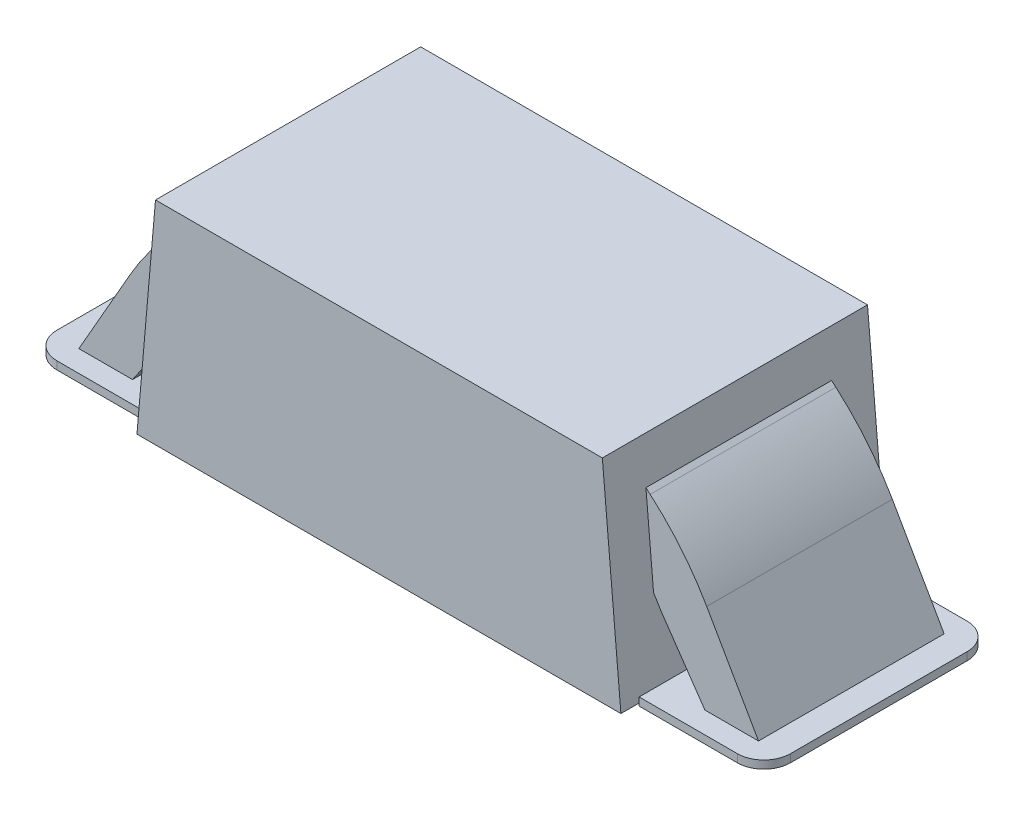
ISO-10303-21;
HEADER;
FILE_DESCRIPTION(('STEP AP214'),'2;1');
FILE_NAME('part.step','',(''),(''),'','','');
FILE_SCHEMA(('AUTOMOTIVE_DESIGN { 1 0 10303 214 1 1 1 1 }'));
ENDSEC;
DATA;
#1=APPLICATION_CONTEXT('core data for automotive mechanical design processes');
#2=APPLICATION_PROTOCOL_DEFINITION('international standard','automotive_design',2000,#1);
#3=PRODUCT_CONTEXT('',#1,'mechanical');
#4=PRODUCT('Part','Part','',(#3));
#5=PRODUCT_RELATED_PRODUCT_CATEGORY('part','',(#4));
#6=PRODUCT_DEFINITION_FORMATION('','',#4);
#7=PRODUCT_DEFINITION_CONTEXT('part definition',#1,'design');
#8=PRODUCT_DEFINITION('design','',#6,#7);
#9=PRODUCT_DEFINITION_SHAPE('','',#8);
#10=(LENGTH_UNIT() NAMED_UNIT(*) SI_UNIT(.MILLI.,.METRE.));
#11=(NAMED_UNIT(*) PLANE_ANGLE_UNIT() SI_UNIT($,.RADIAN.));
#12=(NAMED_UNIT(*) SI_UNIT($,.STERADIAN.) SOLID_ANGLE_UNIT());
#13=UNCERTAINTY_MEASURE_WITH_UNIT(LENGTH_MEASURE(1.E-05),#10,'distance_accuracy_value','');
#14=(GEOMETRIC_REPRESENTATION_CONTEXT(3) GLOBAL_UNCERTAINTY_ASSIGNED_CONTEXT((#13)) GLOBAL_UNIT_ASSIGNED_CONTEXT((#10,
#11,#12)) REPRESENTATION_CONTEXT('',''));
#15=CARTESIAN_POINT('',(0.,0.,0.));
#16=DIRECTION('',(0.,0.,1.));
#17=DIRECTION('',(1.,0.,0.));
#18=AXIS2_PLACEMENT_3D('',#15,#16,#17);
#19=CARTESIAN_POINT('',(0.912502267294813,0.02,0.431230723506814));
#20=DIRECTION('',(-1.,0.,0.));
#21=DIRECTION('',(0.,0.,-1.));
#22=AXIS2_PLACEMENT_3D('',#19,#20,#21);
#23=PLANE('',#22);
#24=DIRECTION('',(0.,-1.,0.));
#25=VECTOR('',#24,1.);
#26=CARTESIAN_POINT('',(0.912502267294813,0.02,0.431230723506814));
#27=LINE('',#26,#25);
#28=CARTESIAN_POINT('',(0.912502267294813,0.02,0.431230723506814));
#29=VERTEX_POINT('',#28);
#30=CARTESIAN_POINT('',(0.912502267294813,-0.01,0.431230723506814));
#31=VERTEX_POINT('',#30);
#32=EDGE_CURVE('P0_E190',#29,#31,#27,.T.);
#33=ORIENTED_EDGE('',*,*,#32,.F.);
#34=DIRECTION('',(0.,0.,1.));
#35=VECTOR('',#34,1.);
#36=CARTESIAN_POINT('',(0.912502267294813,0.02,0.431230723506814));
#37=LINE('',#36,#35);
#38=CARTESIAN_POINT('',(0.912502267294813,0.02,-0.434919537781297));
#39=VERTEX_POINT('',#38);
#40=EDGE_CURVE('P0_E179',#39,#29,#37,.T.);
#41=ORIENTED_EDGE('',*,*,#40,.F.);
#42=DIRECTION('',(0.,-1.,0.));
#43=VECTOR('',#42,1.);
#44=CARTESIAN_POINT('',(0.912502267294813,0.02,-0.434919537781297));
#45=LINE('',#44,#43);
#46=CARTESIAN_POINT('',(0.912502267294813,-0.01,-0.434919537781297));
#47=VERTEX_POINT('',#46);
#48=EDGE_CURVE('P0_E191',#39,#47,#45,.T.);
#49=ORIENTED_EDGE('',*,*,#48,.T.);
#50=DIRECTION('',(0.,0.,1.));
#51=VECTOR('',#50,1.);
#52=CARTESIAN_POINT('',(0.912502267294813,-0.01,0.431230723506814));
#53=LINE('',#52,#51);
#54=EDGE_CURVE('P0_E135',#47,#31,#53,.T.);
#55=ORIENTED_EDGE('',*,*,#54,.T.);
#56=EDGE_LOOP('',(#33,#41,#49,#55));
#57=FACE_BOUND('',#56,.T.);
#58=ADVANCED_FACE('P0_F17',(#57),#23,.T.);
#59=CARTESIAN_POINT('',(0.912502267294813,0.02,-0.434919537781297));
#60=DIRECTION('',(0.,0.,-1.));
#61=DIRECTION('',(1.,0.,0.));
#62=AXIS2_PLACEMENT_3D('',#59,#60,#61);
#63=PLANE('',#62);
#64=DIRECTION('',(-1.,0.,0.));
#65=VECTOR('',#64,1.);
#66=CARTESIAN_POINT('',(0.912502267294813,-0.01,-0.434919537781297));
#67=LINE('',#66,#65);
#68=CARTESIAN_POINT('',(1.28304789740573,-0.01,-0.434919537781297));
#69=VERTEX_POINT('',#68);
#70=EDGE_CURVE('P0_E177',#69,#47,#67,.T.);
#71=ORIENTED_EDGE('',*,*,#70,.T.);
#72=ORIENTED_EDGE('',*,*,#48,.F.);
#73=DIRECTION('',(-1.,0.,0.));
#74=VECTOR('',#73,1.);
#75=CARTESIAN_POINT('',(0.912502267294813,0.02,-0.434919537781297));
#76=LINE('',#75,#74);
#77=CARTESIAN_POINT('',(1.28304789740573,0.02,-0.434919537781297));
#78=VERTEX_POINT('',#77);
#79=EDGE_CURVE('P0_E188',#78,#39,#76,.T.);
#80=ORIENTED_EDGE('',*,*,#79,.F.);
#81=DIRECTION('',(0.,-1.,0.));
#82=VECTOR('',#81,1.);
#83=CARTESIAN_POINT('',(1.28304789740573,0.02,-0.434919537781297));
#84=LINE('',#83,#82);
#85=EDGE_CURVE('P0_E205',#69,#78,#84,.F.);
#86=ORIENTED_EDGE('',*,*,#85,.F.);
#87=EDGE_LOOP('',(#71,#72,#80,#86));
#88=FACE_BOUND('',#87,.T.);
#89=ADVANCED_FACE('P0_F242',(#88),#63,.T.);
#90=CARTESIAN_POINT('',(1.38304789740573,0.02,0.431230723506814));
#91=DIRECTION('',(1.,0.,0.));
#92=DIRECTION('',(0.,0.,1.));
#93=AXIS2_PLACEMENT_3D('',#90,#91,#92);
#94=PLANE('',#93);
#95=DIRECTION('',(0.,0.,-1.));
#96=VECTOR('',#95,1.);
#97=CARTESIAN_POINT('',(1.38304789740573,0.02,0.431230723506814));
#98=LINE('',#97,#96);
#99=CARTESIAN_POINT('',(1.38304789740573,0.02,0.331230723506814));
#100=VERTEX_POINT('',#99);
#101=CARTESIAN_POINT('',(1.38304789740573,0.02,-0.334919537781298));
#102=VERTEX_POINT('',#101);
#103=EDGE_CURVE('P0_E185',#100,#102,#98,.T.);
#104=ORIENTED_EDGE('',*,*,#103,.F.);
#105=DIRECTION('',(0.,-1.,0.));
#106=VECTOR('',#105,1.);
#107=CARTESIAN_POINT('',(1.38304789740573,0.02,0.331230723506814));
#108=LINE('',#107,#106);
#109=CARTESIAN_POINT('',(1.38304789740573,-0.01,0.331230723506814));
#110=VERTEX_POINT('',#109);
#111=EDGE_CURVE('P0_E194',#110,#100,#108,.F.);
#112=ORIENTED_EDGE('',*,*,#111,.F.);
#113=DIRECTION('',(0.,0.,-1.));
#114=VECTOR('',#113,1.);
#115=CARTESIAN_POINT('',(1.38304789740573,-0.01,0.431230723506814));
#116=LINE('',#115,#114);
#117=CARTESIAN_POINT('',(1.38304789740573,-0.01,-0.334919537781298));
#118=VERTEX_POINT('',#117);
#119=EDGE_CURVE('P0_E174',#110,#118,#116,.T.);
#120=ORIENTED_EDGE('',*,*,#119,.T.);
#121=DIRECTION('',(0.,-1.,0.));
#122=VECTOR('',#121,1.);
#123=CARTESIAN_POINT('',(1.38304789740573,0.02,-0.334919537781298));
#124=LINE('',#123,#122);
#125=EDGE_CURVE('P0_E198',#102,#118,#124,.T.);
#126=ORIENTED_EDGE('',*,*,#125,.F.);
#127=EDGE_LOOP('',(#104,#112,#120,#126));
#128=FACE_BOUND('',#127,.T.);
#129=ADVANCED_FACE('P0_F248',(#128),#94,.T.);
#130=CARTESIAN_POINT('',(0.912502267294813,0.02,0.431230723506814));
#131=DIRECTION('',(0.,0.,1.));
#132=DIRECTION('',(-1.,0.,0.));
#133=AXIS2_PLACEMENT_3D('',#130,#131,#132);
#134=PLANE('',#133);
#135=DIRECTION('',(1.,0.,0.));
#136=VECTOR('',#135,1.);
#137=CARTESIAN_POINT('',(0.912502267294813,0.02,0.431230723506814));
#138=LINE('',#137,#136);
#139=CARTESIAN_POINT('',(1.28304789740573,0.02,0.431230723506814));
#140=VERTEX_POINT('',#139);
#141=EDGE_CURVE('P0_E182',#29,#140,#138,.T.);
#142=ORIENTED_EDGE('',*,*,#141,.F.);
#143=ORIENTED_EDGE('',*,*,#32,.T.);
#144=DIRECTION('',(1.,0.,0.));
#145=VECTOR('',#144,1.);
#146=CARTESIAN_POINT('',(0.912502267294813,-0.01,0.431230723506814));
#147=LINE('',#146,#145);
#148=CARTESIAN_POINT('',(1.28304789740573,-0.01,0.431230723506814));
#149=VERTEX_POINT('',#148);
#150=EDGE_CURVE('P0_E171',#31,#149,#147,.T.);
#151=ORIENTED_EDGE('',*,*,#150,.T.);
#152=DIRECTION('',(0.,-1.,0.));
#153=VECTOR('',#152,1.);
#154=CARTESIAN_POINT('',(1.28304789740573,0.02,0.431230723506814));
#155=LINE('',#154,#153);
#156=EDGE_CURVE('P0_E211',#140,#149,#155,.T.);
#157=ORIENTED_EDGE('',*,*,#156,.F.);
#158=EDGE_LOOP('',(#142,#143,#151,#157));
#159=FACE_BOUND('',#158,.T.);
#160=ADVANCED_FACE('P0_F253',(#159),#134,.T.);
#161=CARTESIAN_POINT('',(0.,0.02,0.));
#162=DIRECTION('',(0.,1.,0.));
#163=DIRECTION('',(0.,0.,1.));
#164=AXIS2_PLACEMENT_3D('',#161,#162,#163);
#165=PLANE('',#164);
#166=DIRECTION('',(-1.,0.,0.));
#167=VECTOR('',#166,1.);
#168=CARTESIAN_POINT('',(0.,0.02,0.35));
#169=LINE('',#168,#167);
#170=CARTESIAN_POINT('',(1.28144697539297,0.02,0.35));
#171=VERTEX_POINT('',#170);
#172=CARTESIAN_POINT('',(1.07913504314039,0.02,0.35));
#173=VERTEX_POINT('',#172);
#174=EDGE_CURVE('P0_E11',#171,#173,#169,.T.);
#175=ORIENTED_EDGE('',*,*,#174,.T.);
#176=DIRECTION('',(0.,0.,1.));
#177=VECTOR('',#176,1.);
#178=CARTESIAN_POINT('',(1.07913504314039,0.02,0.));
#179=LINE('',#178,#177);
#180=CARTESIAN_POINT('',(1.07913504314039,0.02,-0.35));
#181=VERTEX_POINT('',#180);
#182=EDGE_CURVE('P0_E215',#181,#173,#179,.T.);
#183=ORIENTED_EDGE('',*,*,#182,.F.);
#184=DIRECTION('',(-1.,0.,0.));
#185=VECTOR('',#184,1.);
#186=CARTESIAN_POINT('',(0.,0.02,-0.35));
#187=LINE('',#186,#185);
#188=CARTESIAN_POINT('',(1.28144697539297,0.02,-0.35));
#189=VERTEX_POINT('',#188);
#190=EDGE_CURVE('P0_E213',#189,#181,#187,.T.);
#191=ORIENTED_EDGE('',*,*,#190,.F.);
#192=DIRECTION('',(0.,0.,-1.));
#193=VECTOR('',#192,1.);
#194=CARTESIAN_POINT('',(1.28144697539297,0.02,0.));
#195=LINE('',#194,#193);
#196=EDGE_CURVE('P0_E25',#171,#189,#195,.T.);
#197=ORIENTED_EDGE('',*,*,#196,.F.);
#198=EDGE_LOOP('',(#175,#183,#191,#197));
#199=FACE_BOUND('',#198,.T.);
#200=ORIENTED_EDGE('',*,*,#79,.T.);
#201=ORIENTED_EDGE('',*,*,#40,.T.);
#202=ORIENTED_EDGE('',*,*,#141,.T.);
#203=CARTESIAN_POINT('',(1.28304789740573,0.02,0.331230723506814));
#204=DIRECTION('',(0.,-1.,0.));
#205=DIRECTION('',(0.,0.,1.));
#206=AXIS2_PLACEMENT_3D('',#203,#204,#205);
#207=CIRCLE('',#206,0.1);
#208=EDGE_CURVE('P0_E40',#100,#140,#207,.T.);
#209=ORIENTED_EDGE('',*,*,#208,.F.);
#210=ORIENTED_EDGE('',*,*,#103,.T.);
#211=CARTESIAN_POINT('',(1.28304789740573,0.02,-0.334919537781298));
#212=DIRECTION('',(0.,-1.,0.));
#213=DIRECTION('',(0.,0.,1.));
#214=AXIS2_PLACEMENT_3D('',#211,#212,#213);
#215=CIRCLE('',#214,0.1);
#216=EDGE_CURVE('P0_E209',#78,#102,#215,.T.);
#217=ORIENTED_EDGE('',*,*,#216,.F.);
#218=EDGE_LOOP('',(#200,#201,#202,#209,#210,#217));
#219=FACE_BOUND('',#218,.T.);
#220=ADVANCED_FACE('P0_F225',(#199,#219),#165,.T.);
#221=CARTESIAN_POINT('',(0.,-0.01,0.));
#222=DIRECTION('',(0.,1.,0.));
#223=DIRECTION('',(0.,0.,1.));
#224=AXIS2_PLACEMENT_3D('',#221,#222,#223);
#225=PLANE('',#224);
#226=ORIENTED_EDGE('',*,*,#119,.F.);
#227=CARTESIAN_POINT('',(1.28304789740573,-0.01,0.331230723506814));
#228=DIRECTION('',(0.,-1.,0.));
#229=DIRECTION('',(0.,0.,1.));
#230=AXIS2_PLACEMENT_3D('',#227,#228,#229);
#231=CIRCLE('',#230,0.1);
#232=EDGE_CURVE('P0_E201',#149,#110,#231,.F.);
#233=ORIENTED_EDGE('',*,*,#232,.F.);
#234=ORIENTED_EDGE('',*,*,#150,.F.);
#235=ORIENTED_EDGE('',*,*,#54,.F.);
#236=ORIENTED_EDGE('',*,*,#70,.F.);
#237=CARTESIAN_POINT('',(1.28304789740573,-0.01,-0.334919537781298));
#238=DIRECTION('',(0.,-1.,0.));
#239=DIRECTION('',(0.,0.,1.));
#240=AXIS2_PLACEMENT_3D('',#237,#238,#239);
#241=CIRCLE('',#240,0.1);
#242=EDGE_CURVE('P0_E203',#118,#69,#241,.F.);
#243=ORIENTED_EDGE('',*,*,#242,.F.);
#244=EDGE_LOOP('',(#226,#233,#234,#235,#236,#243));
#245=FACE_BOUND('',#244,.T.);
#246=ADVANCED_FACE('P0_F257',(#245),#225,.F.);
#247=CARTESIAN_POINT('',(1.28304789740573,0.02,-0.334919537781298));
#248=DIRECTION('',(0.,-1.,0.));
#249=DIRECTION('',(0.,0.,-1.));
#250=AXIS2_PLACEMENT_3D('',#247,#248,#249);
#251=CYLINDRICAL_SURFACE('',#250,0.1);
#252=ORIENTED_EDGE('',*,*,#216,.T.);
#253=ORIENTED_EDGE('',*,*,#125,.T.);
#254=ORIENTED_EDGE('',*,*,#242,.T.);
#255=ORIENTED_EDGE('',*,*,#85,.T.);
#256=EDGE_LOOP('',(#252,#253,#254,#255));
#257=FACE_BOUND('',#256,.T.);
#258=ADVANCED_FACE('P0_F255',(#257),#251,.T.);
#259=CARTESIAN_POINT('',(1.28304789740573,0.02,0.331230723506814));
#260=DIRECTION('',(0.,-1.,0.));
#261=DIRECTION('',(0.,0.,-1.));
#262=AXIS2_PLACEMENT_3D('',#259,#260,#261);
#263=CYLINDRICAL_SURFACE('',#262,0.1);
#264=ORIENTED_EDGE('',*,*,#208,.T.);
#265=ORIENTED_EDGE('',*,*,#156,.T.);
#266=ORIENTED_EDGE('',*,*,#232,.T.);
#267=ORIENTED_EDGE('',*,*,#111,.T.);
#268=EDGE_LOOP('',(#264,#265,#266,#267));
#269=FACE_BOUND('',#268,.T.);
#270=ADVANCED_FACE('P0_F19',(#269),#263,.T.);
#271=CARTESIAN_POINT('',(0.856937476192038,0.635108468496678,0.35));
#272=DIRECTION('',(0.996194698091745,0.0871557427476654,0.));
#273=DIRECTION('',(0.0871557427476654,-0.996194698091745,0.));
#274=AXIS2_PLACEMENT_3D('',#271,#272,#273);
#275=PLANE('',#274);
#276=DIRECTION('',(-0.0871557427476654,0.996194698091745,0.));
#277=VECTOR('',#276,1.);
#278=CARTESIAN_POINT('',(0.856937476192038,0.635108468496678,-0.35));
#279=LINE('',#278,#277);
#280=CARTESIAN_POINT('',(0.885722482558173,0.306094340196465,-0.35));
#281=VERTEX_POINT('',#280);
#282=CARTESIAN_POINT('',(0.856937476192038,0.635108468496678,-0.35));
#283=VERTEX_POINT('',#282);
#284=EDGE_CURVE('P0_E153',#281,#283,#279,.T.);
#285=ORIENTED_EDGE('',*,*,#284,.F.);
#286=DIRECTION('',(0.,0.,-1.));
#287=VECTOR('',#286,1.);
#288=CARTESIAN_POINT('',(0.885722482558173,0.306094340196465,0.35));
#289=LINE('',#288,#287);
#290=CARTESIAN_POINT('',(0.885722482558173,0.306094340196465,0.35));
#291=VERTEX_POINT('',#290);
#292=EDGE_CURVE('P0_E140',#291,#281,#289,.T.);
#293=ORIENTED_EDGE('',*,*,#292,.F.);
#294=DIRECTION('',(-0.0871557427476654,0.996194698091745,0.));
#295=VECTOR('',#294,1.);
#296=CARTESIAN_POINT('',(0.856937476192038,0.635108468496678,0.35));
#297=LINE('',#296,#295);
#298=CARTESIAN_POINT('',(0.856937476192038,0.635108468496678,0.35));
#299=VERTEX_POINT('',#298);
#300=EDGE_CURVE('P0_E119',#291,#299,#297,.T.);
#301=ORIENTED_EDGE('',*,*,#300,.T.);
#302=DIRECTION('',(0.,0.,-1.));
#303=VECTOR('',#302,1.);
#304=CARTESIAN_POINT('',(0.856937476192038,0.635108468496678,0.35));
#305=LINE('',#304,#303);
#306=EDGE_CURVE('P0_E128',#299,#283,#305,.T.);
#307=ORIENTED_EDGE('',*,*,#306,.T.);
#308=EDGE_LOOP('',(#285,#293,#301,#307));
#309=FACE_BOUND('',#308,.T.);
#310=ADVANCED_FACE('P0_F138',(#309),#275,.F.);
#311=CARTESIAN_POINT('',(0.856937476192038,0.635108468496678,0.35));
#312=DIRECTION('',(-0.6551429084521,-0.755504976492494,0.));
#313=DIRECTION('',(-0.755504976492494,0.6551429084521,0.));
#314=AXIS2_PLACEMENT_3D('',#311,#312,#313);
#315=PLANE('',#314);
#316=DIRECTION('',(0.755504976492494,-0.655142908452099,0.));
#317=VECTOR('',#316,1.);
#318=CARTESIAN_POINT('',(0.856937476192038,0.635108468496678,-0.35));
#319=LINE('',#318,#317);
#320=CARTESIAN_POINT('',(0.873023804777973,0.621159064556239,-0.35));
#321=VERTEX_POINT('',#320);
#322=EDGE_CURVE('P0_E131',#283,#321,#319,.T.);
#323=ORIENTED_EDGE('',*,*,#322,.F.);
#324=ORIENTED_EDGE('',*,*,#306,.F.);
#325=DIRECTION('',(0.755504976492494,-0.655142908452099,0.));
#326=VECTOR('',#325,1.);
#327=CARTESIAN_POINT('',(0.856937476192038,0.635108468496678,0.35));
#328=LINE('',#327,#326);
#329=CARTESIAN_POINT('',(0.873023804777973,0.621159064556239,0.35));
#330=VERTEX_POINT('',#329);
#331=EDGE_CURVE('P0_E115',#299,#330,#328,.T.);
#332=ORIENTED_EDGE('',*,*,#331,.T.);
#333=DIRECTION('',(0.,0.,-1.));
#334=VECTOR('',#333,1.);
#335=CARTESIAN_POINT('',(0.873023804777973,0.621159064556239,0.35));
#336=LINE('',#335,#334);
#337=EDGE_CURVE('P0_E136',#330,#321,#336,.T.);
#338=ORIENTED_EDGE('',*,*,#337,.T.);
#339=EDGE_LOOP('',(#323,#324,#332,#338));
#340=FACE_BOUND('',#339,.T.);
#341=ADVANCED_FACE('P0_F129',(#340),#315,.F.);
#342=CARTESIAN_POINT('',(0.217880896325886,-0.134345911936265,0.35));
#343=DIRECTION('',(0.,0.,-1.));
#344=DIRECTION('',(1.,0.,0.));
#345=AXIS2_PLACEMENT_3D('',#342,#343,#344);
#346=CYLINDRICAL_SURFACE('',#345,1.);
#347=CARTESIAN_POINT('',(0.217880896325886,-0.134345911936265,-0.35));
#348=DIRECTION('',(0.,0.,-1.));
#349=DIRECTION('',(-1.,0.,0.));
#350=AXIS2_PLACEMENT_3D('',#347,#348,#349);
#351=CIRCLE('',#350,1.);
#352=CARTESIAN_POINT('',(1.08611021153654,0.361817222737039,-0.35));
#353=VERTEX_POINT('',#352);
#354=EDGE_CURVE('P0_E156',#321,#353,#351,.T.);
#355=ORIENTED_EDGE('',*,*,#354,.F.);
#356=ORIENTED_EDGE('',*,*,#337,.F.);
#357=CARTESIAN_POINT('',(0.217880896325886,-0.134345911936265,0.35));
#358=DIRECTION('',(0.,0.,-1.));
#359=DIRECTION('',(-1.,0.,0.));
#360=AXIS2_PLACEMENT_3D('',#357,#358,#359);
#361=CIRCLE('',#360,1.);
#362=CARTESIAN_POINT('',(1.08611021153654,0.361817222737039,0.35));
#363=VERTEX_POINT('',#362);
#364=EDGE_CURVE('P0_E122',#330,#363,#361,.T.);
#365=ORIENTED_EDGE('',*,*,#364,.T.);
#366=DIRECTION('',(0.,0.,-1.));
#367=VECTOR('',#366,1.);
#368=CARTESIAN_POINT('',(1.08611021153654,0.361817222737039,0.35));
#369=LINE('',#368,#367);
#370=EDGE_CURVE('P0_E165',#363,#353,#369,.T.);
#371=ORIENTED_EDGE('',*,*,#370,.T.);
#372=EDGE_LOOP('',(#355,#356,#365,#371));
#373=FACE_BOUND('',#372,.T.);
#374=ADVANCED_FACE('P0_F230',(#373),#346,.T.);
#375=CARTESIAN_POINT('',(1.08611021153654,0.36181722273704,0.35));
#376=DIRECTION('',(-0.868229315210654,-0.496163134673305,0.));
#377=DIRECTION('',(-0.496163134673305,0.868229315210654,0.));
#378=AXIS2_PLACEMENT_3D('',#375,#376,#377);
#379=PLANE('',#378);
#380=ORIENTED_EDGE('',*,*,#196,.T.);
#381=DIRECTION('',(0.496163134673305,-0.868229315210653,0.));
#382=VECTOR('',#381,1.);
#383=CARTESIAN_POINT('',(1.08611021153654,0.36181722273704,-0.35));
#384=LINE('',#383,#382);
#385=EDGE_CURVE('P0_E159',#353,#189,#384,.T.);
#386=ORIENTED_EDGE('',*,*,#385,.F.);
#387=ORIENTED_EDGE('',*,*,#370,.F.);
#388=DIRECTION('',(0.496163134673305,-0.868229315210653,0.));
#389=VECTOR('',#388,1.);
#390=CARTESIAN_POINT('',(1.08611021153654,0.36181722273704,0.35));
#391=LINE('',#390,#389);
#392=EDGE_CURVE('P0_E146',#363,#171,#391,.T.);
#393=ORIENTED_EDGE('',*,*,#392,.T.);
#394=EDGE_LOOP('',(#380,#386,#387,#393));
#395=FACE_BOUND('',#394,.T.);
#396=ADVANCED_FACE('P0_F220',(#395),#379,.F.);
#397=CARTESIAN_POINT('',(0.912464348494408,0.262584595802379,0.35));
#398=DIRECTION('',(0.824210361376243,0.566283745307988,0.));
#399=DIRECTION('',(0.566283745307988,-0.824210361376243,0.));
#400=AXIS2_PLACEMENT_3D('',#397,#398,#399);
#401=PLANE('',#400);
#402=ORIENTED_EDGE('',*,*,#182,.T.);
#403=DIRECTION('',(-0.566283745307988,0.824210361376243,0.));
#404=VECTOR('',#403,1.);
#405=CARTESIAN_POINT('',(0.912464348494408,0.262584595802379,0.35));
#406=LINE('',#405,#404);
#407=CARTESIAN_POINT('',(0.912464348494408,0.262584595802379,0.35));
#408=VERTEX_POINT('',#407);
#409=EDGE_CURVE('P0_E148',#173,#408,#406,.T.);
#410=ORIENTED_EDGE('',*,*,#409,.T.);
#411=DIRECTION('',(0.,0.,-1.));
#412=VECTOR('',#411,1.);
#413=CARTESIAN_POINT('',(0.912464348494408,0.262584595802379,0.35));
#414=LINE('',#413,#412);
#415=CARTESIAN_POINT('',(0.912464348494408,0.262584595802379,-0.35));
#416=VERTEX_POINT('',#415);
#417=EDGE_CURVE('P0_E163',#408,#416,#414,.T.);
#418=ORIENTED_EDGE('',*,*,#417,.T.);
#419=DIRECTION('',(-0.566283745307988,0.824210361376243,0.));
#420=VECTOR('',#419,1.);
#421=CARTESIAN_POINT('',(0.912464348494408,0.262584595802379,-0.35));
#422=LINE('',#421,#420);
#423=EDGE_CURVE('P0_E32',#181,#416,#422,.T.);
#424=ORIENTED_EDGE('',*,*,#423,.F.);
#425=EDGE_LOOP('',(#402,#410,#418,#424));
#426=FACE_BOUND('',#425,.T.);
#427=ADVANCED_FACE('P0_F238',(#426),#401,.F.);
#428=CARTESIAN_POINT('',(0.217880896325886,-0.134345911936265,0.35));
#429=DIRECTION('',(0.,0.,-1.));
#430=DIRECTION('',(1.,0.,0.));
#431=AXIS2_PLACEMENT_3D('',#428,#429,#430);
#432=CYLINDRICAL_SURFACE('',#431,0.8);
#433=CARTESIAN_POINT('',(0.217880896325886,-0.134345911936265,-0.35));
#434=DIRECTION('',(0.,0.,1.));
#435=DIRECTION('',(-1.,0.,0.));
#436=AXIS2_PLACEMENT_3D('',#433,#434,#435);
#437=CIRCLE('',#436,0.8);
#438=EDGE_CURVE('P0_E141',#416,#281,#437,.T.);
#439=ORIENTED_EDGE('',*,*,#438,.F.);
#440=ORIENTED_EDGE('',*,*,#417,.F.);
#441=CARTESIAN_POINT('',(0.217880896325886,-0.134345911936265,0.35));
#442=DIRECTION('',(0.,0.,1.));
#443=DIRECTION('',(-1.,0.,0.));
#444=AXIS2_PLACEMENT_3D('',#441,#442,#443);
#445=CIRCLE('',#444,0.8);
#446=EDGE_CURVE('P0_E151',#408,#291,#445,.T.);
#447=ORIENTED_EDGE('',*,*,#446,.T.);
#448=ORIENTED_EDGE('',*,*,#292,.T.);
#449=EDGE_LOOP('',(#439,#440,#447,#448));
#450=FACE_BOUND('',#449,.T.);
#451=ADVANCED_FACE('P0_F322',(#450),#432,.F.);
#452=CARTESIAN_POINT('',(0.217880896325886,-0.134345911936265,0.35));
#453=DIRECTION('',(0.,0.,1.));
#454=DIRECTION('',(-1.,0.,0.));
#455=AXIS2_PLACEMENT_3D('',#452,#453,#454);
#456=PLANE('',#455);
#457=ORIENTED_EDGE('',*,*,#392,.F.);
#458=ORIENTED_EDGE('',*,*,#364,.F.);
#459=ORIENTED_EDGE('',*,*,#331,.F.);
#460=ORIENTED_EDGE('',*,*,#300,.F.);
#461=ORIENTED_EDGE('',*,*,#446,.F.);
#462=ORIENTED_EDGE('',*,*,#409,.F.);
#463=ORIENTED_EDGE('',*,*,#174,.F.);
#464=EDGE_LOOP('',(#457,#458,#459,#460,#461,#462,#463));
#465=FACE_BOUND('',#464,.T.);
#466=ADVANCED_FACE('P0_F117',(#465),#456,.T.);
#467=CARTESIAN_POINT('',(0.217880896325886,-0.134345911936265,-0.35));
#468=DIRECTION('',(0.,0.,1.));
#469=DIRECTION('',(-1.,0.,0.));
#470=AXIS2_PLACEMENT_3D('',#467,#468,#469);
#471=PLANE('',#470);
#472=ORIENTED_EDGE('',*,*,#190,.T.);
#473=ORIENTED_EDGE('',*,*,#423,.T.);
#474=ORIENTED_EDGE('',*,*,#438,.T.);
#475=ORIENTED_EDGE('',*,*,#284,.T.);
#476=ORIENTED_EDGE('',*,*,#322,.T.);
#477=ORIENTED_EDGE('',*,*,#354,.T.);
#478=ORIENTED_EDGE('',*,*,#385,.T.);
#479=EDGE_LOOP('',(#472,#473,#474,#475,#476,#477,#478));
#480=FACE_BOUND('',#479,.T.);
#481=ADVANCED_FACE('P0_F228',(#480),#471,.F.);
#482=CLOSED_SHELL('',(#58,#89,#129,#160,#220,#246,#258,#270,#310,#341,#374,#396,#427,#451,#466,#481));
#483=MANIFOLD_SOLID_BREP('P0_B1',#482);
#484=CARTESIAN_POINT('',(-0.912502267294813,0.02,0.431230723506814));
#485=DIRECTION('',(1.,0.,0.));
#486=DIRECTION('',(0.,0.,-1.));
#487=AXIS2_PLACEMENT_3D('',#484,#485,#486);
#488=PLANE('',#487);
#489=DIRECTION('',(0.,-1.,0.));
#490=VECTOR('',#489,1.);
#491=CARTESIAN_POINT('',(-0.912502267294813,0.02,0.431230723506814));
#492=LINE('',#491,#490);
#493=CARTESIAN_POINT('',(-0.912502267294813,0.02,0.431230723506814));
#494=VERTEX_POINT('',#493);
#495=CARTESIAN_POINT('',(-0.912502267294813,-0.01,0.431230723506814));
#496=VERTEX_POINT('',#495);
#497=EDGE_CURVE('P1_E165',#494,#496,#492,.T.);
#498=ORIENTED_EDGE('',*,*,#497,.T.);
#499=DIRECTION('',(0.,0.,1.));
#500=VECTOR('',#499,1.);
#501=CARTESIAN_POINT('',(-0.912502267294813,-0.01,0.431230723506814));
#502=LINE('',#501,#500);
#503=CARTESIAN_POINT('',(-0.912502267294813,-0.01,-0.434919537781297));
#504=VERTEX_POINT('',#503);
#505=EDGE_CURVE('P1_E139',#504,#496,#502,.T.);
#506=ORIENTED_EDGE('',*,*,#505,.F.);
#507=DIRECTION('',(0.,-1.,0.));
#508=VECTOR('',#507,1.);
#509=CARTESIAN_POINT('',(-0.912502267294813,0.02,-0.434919537781297));
#510=LINE('',#509,#508);
#511=CARTESIAN_POINT('',(-0.912502267294813,0.02,-0.434919537781297));
#512=VERTEX_POINT('',#511);
#513=EDGE_CURVE('P1_E166',#512,#504,#510,.T.);
#514=ORIENTED_EDGE('',*,*,#513,.F.);
#515=DIRECTION('',(0.,0.,1.));
#516=VECTOR('',#515,1.);
#517=CARTESIAN_POINT('',(-0.912502267294813,0.02,0.431230723506814));
#518=LINE('',#517,#516);
#519=EDGE_CURVE('P1_E155',#512,#494,#518,.T.);
#520=ORIENTED_EDGE('',*,*,#519,.T.);
#521=EDGE_LOOP('',(#498,#506,#514,#520));
#522=FACE_BOUND('',#521,.T.);
#523=ADVANCED_FACE('P1_F17',(#522),#488,.T.);
#524=CARTESIAN_POINT('',(-0.912502267294813,0.02,-0.434919537781297));
#525=DIRECTION('',(0.,0.,-1.));
#526=DIRECTION('',(-1.,0.,0.));
#527=AXIS2_PLACEMENT_3D('',#524,#525,#526);
#528=PLANE('',#527);
#529=DIRECTION('',(1.,0.,0.));
#530=VECTOR('',#529,1.);
#531=CARTESIAN_POINT('',(-0.912502267294813,-0.01,-0.434919537781297));
#532=LINE('',#531,#530);
#533=CARTESIAN_POINT('',(-1.28304789740573,-0.01,-0.434919537781297));
#534=VERTEX_POINT('',#533);
#535=EDGE_CURVE('P1_E153',#534,#504,#532,.T.);
#536=ORIENTED_EDGE('',*,*,#535,.F.);
#537=DIRECTION('',(0.,-1.,0.));
#538=VECTOR('',#537,1.);
#539=CARTESIAN_POINT('',(-1.28304789740573,0.02,-0.434919537781297));
#540=LINE('',#539,#538);
#541=CARTESIAN_POINT('',(-1.28304789740573,0.02,-0.434919537781297));
#542=VERTEX_POINT('',#541);
#543=EDGE_CURVE('P1_E179',#534,#542,#540,.F.);
#544=ORIENTED_EDGE('',*,*,#543,.T.);
#545=DIRECTION('',(1.,0.,0.));
#546=VECTOR('',#545,1.);
#547=CARTESIAN_POINT('',(-0.912502267294813,0.02,-0.434919537781297));
#548=LINE('',#547,#546);
#549=EDGE_CURVE('P1_E163',#542,#512,#548,.T.);
#550=ORIENTED_EDGE('',*,*,#549,.T.);
#551=ORIENTED_EDGE('',*,*,#513,.T.);
#552=EDGE_LOOP('',(#536,#544,#550,#551));
#553=FACE_BOUND('',#552,.T.);
#554=ADVANCED_FACE('P1_F239',(#553),#528,.T.);
#555=CARTESIAN_POINT('',(-1.38304789740573,0.02,0.431230723506814));
#556=DIRECTION('',(-1.,0.,0.));
#557=DIRECTION('',(0.,0.,1.));
#558=AXIS2_PLACEMENT_3D('',#555,#556,#557);
#559=PLANE('',#558);
#560=DIRECTION('',(0.,0.,-1.));
#561=VECTOR('',#560,1.);
#562=CARTESIAN_POINT('',(-1.38304789740573,0.02,0.431230723506814));
#563=LINE('',#562,#561);
#564=CARTESIAN_POINT('',(-1.38304789740573,0.02,0.331230723506814));
#565=VERTEX_POINT('',#564);
#566=CARTESIAN_POINT('',(-1.38304789740573,0.02,-0.334919537781298));
#567=VERTEX_POINT('',#566);
#568=EDGE_CURVE('P1_E160',#565,#567,#563,.T.);
#569=ORIENTED_EDGE('',*,*,#568,.T.);
#570=DIRECTION('',(0.,-1.,0.));
#571=VECTOR('',#570,1.);
#572=CARTESIAN_POINT('',(-1.38304789740573,0.02,-0.334919537781298));
#573=LINE('',#572,#571);
#574=CARTESIAN_POINT('',(-1.38304789740573,-0.01,-0.334919537781298));
#575=VERTEX_POINT('',#574);
#576=EDGE_CURVE('P1_E172',#567,#575,#573,.T.);
#577=ORIENTED_EDGE('',*,*,#576,.T.);
#578=DIRECTION('',(0.,0.,-1.));
#579=VECTOR('',#578,1.);
#580=CARTESIAN_POINT('',(-1.38304789740573,-0.01,0.431230723506814));
#581=LINE('',#580,#579);
#582=CARTESIAN_POINT('',(-1.38304789740573,-0.01,0.331230723506814));
#583=VERTEX_POINT('',#582);
#584=EDGE_CURVE('P1_E150',#583,#575,#581,.T.);
#585=ORIENTED_EDGE('',*,*,#584,.F.);
#586=DIRECTION('',(0.,-1.,0.));
#587=VECTOR('',#586,1.);
#588=CARTESIAN_POINT('',(-1.38304789740573,0.02,0.331230723506814));
#589=LINE('',#588,#587);
#590=EDGE_CURVE('P1_E169',#583,#565,#589,.F.);
#591=ORIENTED_EDGE('',*,*,#590,.T.);
#592=EDGE_LOOP('',(#569,#577,#585,#591));
#593=FACE_BOUND('',#592,.T.);
#594=ADVANCED_FACE('P1_F245',(#593),#559,.T.);
#595=CARTESIAN_POINT('',(-0.912502267294813,0.02,0.431230723506814));
#596=DIRECTION('',(0.,0.,1.));
#597=DIRECTION('',(1.,0.,0.));
#598=AXIS2_PLACEMENT_3D('',#595,#596,#597);
#599=PLANE('',#598);
#600=DIRECTION('',(-1.,0.,0.));
#601=VECTOR('',#600,1.);
#602=CARTESIAN_POINT('',(-0.912502267294813,0.02,0.431230723506814));
#603=LINE('',#602,#601);
#604=CARTESIAN_POINT('',(-1.28304789740573,0.02,0.431230723506814));
#605=VERTEX_POINT('',#604);
#606=EDGE_CURVE('P1_E158',#494,#605,#603,.T.);
#607=ORIENTED_EDGE('',*,*,#606,.T.);
#608=DIRECTION('',(0.,-1.,0.));
#609=VECTOR('',#608,1.);
#610=CARTESIAN_POINT('',(-1.28304789740573,0.02,0.431230723506814));
#611=LINE('',#610,#609);
#612=CARTESIAN_POINT('',(-1.28304789740573,-0.01,0.431230723506814));
#613=VERTEX_POINT('',#612);
#614=EDGE_CURVE('P1_E184',#605,#613,#611,.T.);
#615=ORIENTED_EDGE('',*,*,#614,.T.);
#616=DIRECTION('',(-1.,0.,0.));
#617=VECTOR('',#616,1.);
#618=CARTESIAN_POINT('',(-0.912502267294813,-0.01,0.431230723506814));
#619=LINE('',#618,#617);
#620=EDGE_CURVE('P1_E142',#496,#613,#619,.T.);
#621=ORIENTED_EDGE('',*,*,#620,.F.);
#622=ORIENTED_EDGE('',*,*,#497,.F.);
#623=EDGE_LOOP('',(#607,#615,#621,#622));
#624=FACE_BOUND('',#623,.T.);
#625=ADVANCED_FACE('P1_F249',(#624),#599,.T.);
#626=CARTESIAN_POINT('',(0.,0.02,0.));
#627=DIRECTION('',(0.,1.,0.));
#628=DIRECTION('',(0.,0.,1.));
#629=AXIS2_PLACEMENT_3D('',#626,#627,#628);
#630=PLANE('',#629);
#631=DIRECTION('',(1.,0.,0.));
#632=VECTOR('',#631,1.);
#633=CARTESIAN_POINT('',(0.,0.02,0.35));
#634=LINE('',#633,#632);
#635=CARTESIAN_POINT('',(-1.28144697539297,0.02,0.35));
#636=VERTEX_POINT('',#635);
#637=CARTESIAN_POINT('',(-1.07913504314039,0.02,0.35));
#638=VERTEX_POINT('',#637);
#639=EDGE_CURVE('P1_E11',#636,#638,#634,.T.);
#640=ORIENTED_EDGE('',*,*,#639,.F.);
#641=DIRECTION('',(0.,0.,-1.));
#642=VECTOR('',#641,1.);
#643=CARTESIAN_POINT('',(-1.28144697539297,0.02,0.));
#644=LINE('',#643,#642);
#645=CARTESIAN_POINT('',(-1.28144697539297,0.02,-0.35));
#646=VERTEX_POINT('',#645);
#647=EDGE_CURVE('P1_E25',#636,#646,#644,.T.);
#648=ORIENTED_EDGE('',*,*,#647,.T.);
#649=DIRECTION('',(1.,0.,0.));
#650=VECTOR('',#649,1.);
#651=CARTESIAN_POINT('',(0.,0.02,-0.35));
#652=LINE('',#651,#650);
#653=CARTESIAN_POINT('',(-1.07913504314039,0.02,-0.35));
#654=VERTEX_POINT('',#653);
#655=EDGE_CURVE('P1_E187',#646,#654,#652,.T.);
#656=ORIENTED_EDGE('',*,*,#655,.T.);
#657=DIRECTION('',(0.,0.,1.));
#658=VECTOR('',#657,1.);
#659=CARTESIAN_POINT('',(-1.07913504314039,0.02,0.));
#660=LINE('',#659,#658);
#661=EDGE_CURVE('P1_E190',#654,#638,#660,.T.);
#662=ORIENTED_EDGE('',*,*,#661,.T.);
#663=EDGE_LOOP('',(#640,#648,#656,#662));
#664=FACE_BOUND('',#663,.T.);
#665=ORIENTED_EDGE('',*,*,#549,.F.);
#666=CARTESIAN_POINT('',(-1.28304789740573,0.02,-0.334919537781298));
#667=DIRECTION('',(0.,1.,0.));
#668=DIRECTION('',(0.,0.,1.));
#669=AXIS2_PLACEMENT_3D('',#666,#667,#668);
#670=CIRCLE('',#669,0.1);
#671=EDGE_CURVE('P1_E182',#542,#567,#670,.T.);
#672=ORIENTED_EDGE('',*,*,#671,.T.);
#673=ORIENTED_EDGE('',*,*,#568,.F.);
#674=CARTESIAN_POINT('',(-1.28304789740573,0.02,0.331230723506814));
#675=DIRECTION('',(0.,1.,0.));
#676=DIRECTION('',(0.,0.,1.));
#677=AXIS2_PLACEMENT_3D('',#674,#675,#676);
#678=CIRCLE('',#677,0.1);
#679=EDGE_CURVE('P1_E40',#565,#605,#678,.T.);
#680=ORIENTED_EDGE('',*,*,#679,.T.);
#681=ORIENTED_EDGE('',*,*,#606,.F.);
#682=ORIENTED_EDGE('',*,*,#519,.F.);
#683=EDGE_LOOP('',(#665,#672,#673,#680,#681,#682));
#684=FACE_BOUND('',#683,.T.);
#685=ADVANCED_FACE('P1_F195',(#664,#684),#630,.T.);
#686=CARTESIAN_POINT('',(0.,-0.01,0.));
#687=DIRECTION('',(0.,1.,0.));
#688=DIRECTION('',(0.,0.,1.));
#689=AXIS2_PLACEMENT_3D('',#686,#687,#688);
#690=PLANE('',#689);
#691=ORIENTED_EDGE('',*,*,#584,.T.);
#692=CARTESIAN_POINT('',(-1.28304789740573,-0.01,-0.334919537781298));
#693=DIRECTION('',(0.,1.,0.));
#694=DIRECTION('',(0.,0.,1.));
#695=AXIS2_PLACEMENT_3D('',#692,#693,#694);
#696=CIRCLE('',#695,0.1);
#697=EDGE_CURVE('P1_E177',#575,#534,#696,.F.);
#698=ORIENTED_EDGE('',*,*,#697,.T.);
#699=ORIENTED_EDGE('',*,*,#535,.T.);
#700=ORIENTED_EDGE('',*,*,#505,.T.);
#701=ORIENTED_EDGE('',*,*,#620,.T.);
#702=CARTESIAN_POINT('',(-1.28304789740573,-0.01,0.331230723506814));
#703=DIRECTION('',(0.,1.,0.));
#704=DIRECTION('',(0.,0.,1.));
#705=AXIS2_PLACEMENT_3D('',#702,#703,#704);
#706=CIRCLE('',#705,0.1);
#707=EDGE_CURVE('P1_E175',#613,#583,#706,.F.);
#708=ORIENTED_EDGE('',*,*,#707,.T.);
#709=EDGE_LOOP('',(#691,#698,#699,#700,#701,#708));
#710=FACE_BOUND('',#709,.T.);
#711=ADVANCED_FACE('P1_F253',(#710),#690,.F.);
#712=CARTESIAN_POINT('',(-1.28304789740573,0.02,-0.334919537781298));
#713=DIRECTION('',(0.,-1.,0.));
#714=DIRECTION('',(0.,0.,-1.));
#715=AXIS2_PLACEMENT_3D('',#712,#713,#714);
#716=CYLINDRICAL_SURFACE('',#715,0.1);
#717=ORIENTED_EDGE('',*,*,#671,.F.);
#718=ORIENTED_EDGE('',*,*,#543,.F.);
#719=ORIENTED_EDGE('',*,*,#697,.F.);
#720=ORIENTED_EDGE('',*,*,#576,.F.);
#721=EDGE_LOOP('',(#717,#718,#719,#720));
#722=FACE_BOUND('',#721,.T.);
#723=ADVANCED_FACE('P1_F251',(#722),#716,.T.);
#724=CARTESIAN_POINT('',(-1.28304789740573,0.02,0.331230723506814));
#725=DIRECTION('',(0.,-1.,0.));
#726=DIRECTION('',(0.,0.,-1.));
#727=AXIS2_PLACEMENT_3D('',#724,#725,#726);
#728=CYLINDRICAL_SURFACE('',#727,0.1);
#729=ORIENTED_EDGE('',*,*,#679,.F.);
#730=ORIENTED_EDGE('',*,*,#590,.F.);
#731=ORIENTED_EDGE('',*,*,#707,.F.);
#732=ORIENTED_EDGE('',*,*,#614,.F.);
#733=EDGE_LOOP('',(#729,#730,#731,#732));
#734=FACE_BOUND('',#733,.T.);
#735=ADVANCED_FACE('P1_F19',(#734),#728,.T.);
#736=CARTESIAN_POINT('',(-0.856937476192038,0.635108468496678,0.35));
#737=DIRECTION('',(-0.996194698091745,0.0871557427476654,0.));
#738=DIRECTION('',(-0.0871557427476654,-0.996194698091745,0.));
#739=AXIS2_PLACEMENT_3D('',#736,#737,#738);
#740=PLANE('',#739);
#741=DIRECTION('',(0.0871557427476654,0.996194698091745,0.));
#742=VECTOR('',#741,1.);
#743=CARTESIAN_POINT('',(-0.856937476192038,0.635108468496678,-0.35));
#744=LINE('',#743,#742);
#745=CARTESIAN_POINT('',(-0.885722482558173,0.306094340196465,-0.35));
#746=VERTEX_POINT('',#745);
#747=CARTESIAN_POINT('',(-0.856937476192038,0.635108468496678,-0.35));
#748=VERTEX_POINT('',#747);
#749=EDGE_CURVE('P1_E138',#746,#748,#744,.T.);
#750=ORIENTED_EDGE('',*,*,#749,.T.);
#751=DIRECTION('',(0.,0.,-1.));
#752=VECTOR('',#751,1.);
#753=CARTESIAN_POINT('',(-0.856937476192038,0.635108468496678,0.35));
#754=LINE('',#753,#752);
#755=CARTESIAN_POINT('',(-0.856937476192038,0.635108468496678,0.35));
#756=VERTEX_POINT('',#755);
#757=EDGE_CURVE('P1_E117',#756,#748,#754,.T.);
#758=ORIENTED_EDGE('',*,*,#757,.F.);
#759=DIRECTION('',(0.0871557427476654,0.996194698091745,0.));
#760=VECTOR('',#759,1.);
#761=CARTESIAN_POINT('',(-0.856937476192038,0.635108468496678,0.35));
#762=LINE('',#761,#760);
#763=CARTESIAN_POINT('',(-0.885722482558173,0.306094340196465,0.35));
#764=VERTEX_POINT('',#763);
#765=EDGE_CURVE('P1_E124',#764,#756,#762,.T.);
#766=ORIENTED_EDGE('',*,*,#765,.F.);
#767=DIRECTION('',(0.,0.,-1.));
#768=VECTOR('',#767,1.);
#769=CARTESIAN_POINT('',(-0.885722482558173,0.306094340196465,0.35));
#770=LINE('',#769,#768);
#771=EDGE_CURVE('P1_E212',#764,#746,#770,.T.);
#772=ORIENTED_EDGE('',*,*,#771,.T.);
#773=EDGE_LOOP('',(#750,#758,#766,#772));
#774=FACE_BOUND('',#773,.T.);
#775=ADVANCED_FACE('P1_F136',(#774),#740,.F.);
#776=CARTESIAN_POINT('',(-0.856937476192038,0.635108468496678,0.35));
#777=DIRECTION('',(0.6551429084521,-0.755504976492494,0.));
#778=DIRECTION('',(0.755504976492494,0.6551429084521,0.));
#779=AXIS2_PLACEMENT_3D('',#776,#777,#778);
#780=PLANE('',#779);
#781=DIRECTION('',(-0.755504976492494,-0.655142908452099,0.));
#782=VECTOR('',#781,1.);
#783=CARTESIAN_POINT('',(-0.856937476192038,0.635108468496678,-0.35));
#784=LINE('',#783,#782);
#785=CARTESIAN_POINT('',(-0.873023804777973,0.621159064556239,-0.35));
#786=VERTEX_POINT('',#785);
#787=EDGE_CURVE('P1_E214',#748,#786,#784,.T.);
#788=ORIENTED_EDGE('',*,*,#787,.T.);
#789=DIRECTION('',(0.,0.,-1.));
#790=VECTOR('',#789,1.);
#791=CARTESIAN_POINT('',(-0.873023804777973,0.621159064556239,0.35));
#792=LINE('',#791,#790);
#793=CARTESIAN_POINT('',(-0.873023804777973,0.621159064556239,0.35));
#794=VERTEX_POINT('',#793);
#795=EDGE_CURVE('P1_E120',#794,#786,#792,.T.);
#796=ORIENTED_EDGE('',*,*,#795,.F.);
#797=DIRECTION('',(-0.755504976492494,-0.655142908452099,0.));
#798=VECTOR('',#797,1.);
#799=CARTESIAN_POINT('',(-0.856937476192038,0.635108468496678,0.35));
#800=LINE('',#799,#798);
#801=EDGE_CURVE('P1_E113',#756,#794,#800,.T.);
#802=ORIENTED_EDGE('',*,*,#801,.F.);
#803=ORIENTED_EDGE('',*,*,#757,.T.);
#804=EDGE_LOOP('',(#788,#796,#802,#803));
#805=FACE_BOUND('',#804,.T.);
#806=ADVANCED_FACE('P1_F115',(#805),#780,.F.);
#807=CARTESIAN_POINT('',(-0.217880896325886,-0.134345911936265,0.35));
#808=DIRECTION('',(0.,0.,-1.));
#809=DIRECTION('',(-1.,0.,0.));
#810=AXIS2_PLACEMENT_3D('',#807,#808,#809);
#811=CYLINDRICAL_SURFACE('',#810,1.);
#812=CARTESIAN_POINT('',(-0.217880896325886,-0.134345911936265,-0.35));
#813=DIRECTION('',(0.,0.,1.));
#814=DIRECTION('',(1.,0.,0.));
#815=AXIS2_PLACEMENT_3D('',#812,#813,#814);
#816=CIRCLE('',#815,1.);
#817=CARTESIAN_POINT('',(-1.08611021153654,0.361817222737039,-0.35));
#818=VERTEX_POINT('',#817);
#819=EDGE_CURVE('P1_E216',#786,#818,#816,.T.);
#820=ORIENTED_EDGE('',*,*,#819,.T.);
#821=DIRECTION('',(0.,0.,-1.));
#822=VECTOR('',#821,1.);
#823=CARTESIAN_POINT('',(-1.08611021153654,0.361817222737039,0.35));
#824=LINE('',#823,#822);
#825=CARTESIAN_POINT('',(-1.08611021153654,0.361817222737039,0.35));
#826=VERTEX_POINT('',#825);
#827=EDGE_CURVE('P1_E144',#826,#818,#824,.T.);
#828=ORIENTED_EDGE('',*,*,#827,.F.);
#829=CARTESIAN_POINT('',(-0.217880896325886,-0.134345911936265,0.35));
#830=DIRECTION('',(0.,0.,1.));
#831=DIRECTION('',(1.,0.,0.));
#832=AXIS2_PLACEMENT_3D('',#829,#830,#831);
#833=CIRCLE('',#832,1.);
#834=EDGE_CURVE('P1_E123',#794,#826,#833,.T.);
#835=ORIENTED_EDGE('',*,*,#834,.F.);
#836=ORIENTED_EDGE('',*,*,#795,.T.);
#837=EDGE_LOOP('',(#820,#828,#835,#836));
#838=FACE_BOUND('',#837,.T.);
#839=ADVANCED_FACE('P1_F227',(#838),#811,.T.);
#840=CARTESIAN_POINT('',(-1.08611021153654,0.36181722273704,0.35));
#841=DIRECTION('',(0.868229315210654,-0.496163134673305,0.));
#842=DIRECTION('',(0.496163134673305,0.868229315210654,0.));
#843=AXIS2_PLACEMENT_3D('',#840,#841,#842);
#844=PLANE('',#843);
#845=ORIENTED_EDGE('',*,*,#647,.F.);
#846=DIRECTION('',(-0.496163134673305,-0.868229315210653,0.));
#847=VECTOR('',#846,1.);
#848=CARTESIAN_POINT('',(-1.08611021153654,0.36181722273704,0.35));
#849=LINE('',#848,#847);
#850=EDGE_CURVE('P1_E201',#826,#636,#849,.T.);
#851=ORIENTED_EDGE('',*,*,#850,.F.);
#852=ORIENTED_EDGE('',*,*,#827,.T.);
#853=DIRECTION('',(-0.496163134673305,-0.868229315210653,0.));
#854=VECTOR('',#853,1.);
#855=CARTESIAN_POINT('',(-1.08611021153654,0.36181722273704,-0.35));
#856=LINE('',#855,#854);
#857=EDGE_CURVE('P1_E203',#818,#646,#856,.T.);
#858=ORIENTED_EDGE('',*,*,#857,.T.);
#859=EDGE_LOOP('',(#845,#851,#852,#858));
#860=FACE_BOUND('',#859,.T.);
#861=ADVANCED_FACE('P1_F199',(#860),#844,.F.);
#862=CARTESIAN_POINT('',(-0.912464348494408,0.262584595802379,0.35));
#863=DIRECTION('',(-0.824210361376243,0.566283745307988,0.));
#864=DIRECTION('',(-0.566283745307988,-0.824210361376243,0.));
#865=AXIS2_PLACEMENT_3D('',#862,#863,#864);
#866=PLANE('',#865);
#867=ORIENTED_EDGE('',*,*,#661,.F.);
#868=DIRECTION('',(0.566283745307988,0.824210361376243,0.));
#869=VECTOR('',#868,1.);
#870=CARTESIAN_POINT('',(-0.912464348494408,0.262584595802379,-0.35));
#871=LINE('',#870,#869);
#872=CARTESIAN_POINT('',(-0.912464348494408,0.262584595802379,-0.35));
#873=VERTEX_POINT('',#872);
#874=EDGE_CURVE('P1_E32',#654,#873,#871,.T.);
#875=ORIENTED_EDGE('',*,*,#874,.T.);
#876=DIRECTION('',(0.,0.,-1.));
#877=VECTOR('',#876,1.);
#878=CARTESIAN_POINT('',(-0.912464348494408,0.262584595802379,0.35));
#879=LINE('',#878,#877);
#880=CARTESIAN_POINT('',(-0.912464348494408,0.262584595802379,0.35));
#881=VERTEX_POINT('',#880);
#882=EDGE_CURVE('P1_E222',#881,#873,#879,.T.);
#883=ORIENTED_EDGE('',*,*,#882,.F.);
#884=DIRECTION('',(0.566283745307988,0.824210361376243,0.));
#885=VECTOR('',#884,1.);
#886=CARTESIAN_POINT('',(-0.912464348494408,0.262584595802379,0.35));
#887=LINE('',#886,#885);
#888=EDGE_CURVE('P1_E206',#638,#881,#887,.T.);
#889=ORIENTED_EDGE('',*,*,#888,.F.);
#890=EDGE_LOOP('',(#867,#875,#883,#889));
#891=FACE_BOUND('',#890,.T.);
#892=ADVANCED_FACE('P1_F235',(#891),#866,.F.);
#893=CARTESIAN_POINT('',(-0.217880896325886,-0.134345911936265,0.35));
#894=DIRECTION('',(0.,0.,-1.));
#895=DIRECTION('',(-1.,0.,0.));
#896=AXIS2_PLACEMENT_3D('',#893,#894,#895);
#897=CYLINDRICAL_SURFACE('',#896,0.8);
#898=CARTESIAN_POINT('',(-0.217880896325886,-0.134345911936265,-0.35));
#899=DIRECTION('',(0.,0.,-1.));
#900=DIRECTION('',(1.,0.,0.));
#901=AXIS2_PLACEMENT_3D('',#898,#899,#900);
#902=CIRCLE('',#901,0.8);
#903=EDGE_CURVE('P1_E134',#873,#746,#902,.T.);
#904=ORIENTED_EDGE('',*,*,#903,.T.);
#905=ORIENTED_EDGE('',*,*,#771,.F.);
#906=CARTESIAN_POINT('',(-0.217880896325886,-0.134345911936265,0.35));
#907=DIRECTION('',(0.,0.,-1.));
#908=DIRECTION('',(1.,0.,0.));
#909=AXIS2_PLACEMENT_3D('',#906,#907,#908);
#910=CIRCLE('',#909,0.8);
#911=EDGE_CURVE('P1_E130',#881,#764,#910,.T.);
#912=ORIENTED_EDGE('',*,*,#911,.F.);
#913=ORIENTED_EDGE('',*,*,#882,.T.);
#914=EDGE_LOOP('',(#904,#905,#912,#913));
#915=FACE_BOUND('',#914,.T.);
#916=ADVANCED_FACE('P1_F321',(#915),#897,.F.);
#917=CARTESIAN_POINT('',(-0.217880896325886,-0.134345911936265,0.35));
#918=DIRECTION('',(0.,0.,1.));
#919=DIRECTION('',(1.,0.,0.));
#920=AXIS2_PLACEMENT_3D('',#917,#918,#919);
#921=PLANE('',#920);
#922=ORIENTED_EDGE('',*,*,#850,.T.);
#923=ORIENTED_EDGE('',*,*,#639,.T.);
#924=ORIENTED_EDGE('',*,*,#888,.T.);
#925=ORIENTED_EDGE('',*,*,#911,.T.);
#926=ORIENTED_EDGE('',*,*,#765,.T.);
#927=ORIENTED_EDGE('',*,*,#801,.T.);
#928=ORIENTED_EDGE('',*,*,#834,.T.);
#929=EDGE_LOOP('',(#922,#923,#924,#925,#926,#927,#928));
#930=FACE_BOUND('',#929,.T.);
#931=ADVANCED_FACE('P1_F128',(#930),#921,.T.);
#932=CARTESIAN_POINT('',(-0.217880896325886,-0.134345911936265,-0.35));
#933=DIRECTION('',(0.,0.,1.));
#934=DIRECTION('',(1.,0.,0.));
#935=AXIS2_PLACEMENT_3D('',#932,#933,#934);
#936=PLANE('',#935);
#937=ORIENTED_EDGE('',*,*,#655,.F.);
#938=ORIENTED_EDGE('',*,*,#857,.F.);
#939=ORIENTED_EDGE('',*,*,#819,.F.);
#940=ORIENTED_EDGE('',*,*,#787,.F.);
#941=ORIENTED_EDGE('',*,*,#749,.F.);
#942=ORIENTED_EDGE('',*,*,#903,.F.);
#943=ORIENTED_EDGE('',*,*,#874,.F.);
#944=EDGE_LOOP('',(#937,#938,#939,#940,#941,#942,#943));
#945=FACE_BOUND('',#944,.T.);
#946=ADVANCED_FACE('P1_F226',(#945),#936,.F.);
#947=CLOSED_SHELL('',(#523,#554,#594,#625,#685,#711,#723,#735,#775,#806,#839,#861,#892,#916,
#931,#946));
#948=MANIFOLD_SOLID_BREP('P1_B1',#947);
#949=CARTESIAN_POINT('',(-0.93,0.8,-0.5));
#950=DIRECTION('',(0.,0.,1.));
#951=DIRECTION('',(1.,0.,0.));
#952=AXIS2_PLACEMENT_3D('',#949,#950,#951);
#953=PLANE('',#952);
#954=DIRECTION('',(-1.,0.,0.));
#955=VECTOR('',#954,1.);
#956=CARTESIAN_POINT('',(-0.93,0.8,-0.5));
#957=LINE('',#956,#955);
#958=CARTESIAN_POINT('',(0.842511336474069,0.8,-0.5));
#959=VERTEX_POINT('',#958);
#960=CARTESIAN_POINT('',(-0.842511336474068,0.8,-0.5));
#961=VERTEX_POINT('',#960);
#962=EDGE_CURVE('P2_E72',#959,#961,#957,.T.);
#963=ORIENTED_EDGE('',*,*,#962,.F.);
#964=DIRECTION('',(-0.0871557427476653,0.996194698091745,0.));
#965=VECTOR('',#964,1.);
#966=CARTESIAN_POINT('',(0.842511336474069,0.8,-0.5));
#967=LINE('',#966,#965);
#968=CARTESIAN_POINT('',(0.912502267294814,0.,-0.5));
#969=VERTEX_POINT('',#968);
#970=EDGE_CURVE('P2_E56',#959,#969,#967,.F.);
#971=ORIENTED_EDGE('',*,*,#970,.T.);
#972=DIRECTION('',(-1.,0.,0.));
#973=VECTOR('',#972,1.);
#974=CARTESIAN_POINT('',(-0.93,0.,-0.5));
#975=LINE('',#974,#973);
#976=CARTESIAN_POINT('',(-0.912502267294813,0.,-0.5));
#977=VERTEX_POINT('',#976);
#978=EDGE_CURVE('P2_E81',#969,#977,#975,.T.);
#979=ORIENTED_EDGE('',*,*,#978,.T.);
#980=DIRECTION('',(-0.0871557427476653,-0.996194698091745,0.));
#981=VECTOR('',#980,1.);
#982=CARTESIAN_POINT('',(-0.842511336474068,0.8,-0.5));
#983=LINE('',#982,#981);
#984=EDGE_CURVE('P2_E65',#977,#961,#983,.F.);
#985=ORIENTED_EDGE('',*,*,#984,.T.);
#986=EDGE_LOOP('',(#963,#971,#979,#985));
#987=FACE_BOUND('',#986,.T.);
#988=ADVANCED_FACE('P2_F17',(#987),#953,.F.);
#989=CARTESIAN_POINT('',(-0.93,0.8,0.5));
#990=DIRECTION('',(0.,0.,-1.));
#991=DIRECTION('',(-1.,0.,0.));
#992=AXIS2_PLACEMENT_3D('',#989,#990,#991);
#993=PLANE('',#992);
#994=DIRECTION('',(1.,0.,0.));
#995=VECTOR('',#994,1.);
#996=CARTESIAN_POINT('',(-0.93,0.,0.5));
#997=LINE('',#996,#995);
#998=CARTESIAN_POINT('',(-0.912502267294813,0.,0.5));
#999=VERTEX_POINT('',#998);
#1000=CARTESIAN_POINT('',(0.912502267294814,0.,0.5));
#1001=VERTEX_POINT('',#1000);
#1002=EDGE_CURVE('P2_E78',#999,#1001,#997,.T.);
#1003=ORIENTED_EDGE('',*,*,#1002,.T.);
#1004=DIRECTION('',(0.0871557427476653,-0.996194698091745,0.));
#1005=VECTOR('',#1004,1.);
#1006=CARTESIAN_POINT('',(0.842511336474069,0.8,0.5));
#1007=LINE('',#1006,#1005);
#1008=CARTESIAN_POINT('',(0.842511336474069,0.8,0.5));
#1009=VERTEX_POINT('',#1008);
#1010=EDGE_CURVE('P2_E11',#1001,#1009,#1007,.F.);
#1011=ORIENTED_EDGE('',*,*,#1010,.T.);
#1012=DIRECTION('',(1.,0.,0.));
#1013=VECTOR('',#1012,1.);
#1014=CARTESIAN_POINT('',(-0.93,0.8,0.5));
#1015=LINE('',#1014,#1013);
#1016=CARTESIAN_POINT('',(-0.842511336474068,0.8,0.5));
#1017=VERTEX_POINT('',#1016);
#1018=EDGE_CURVE('P2_E74',#1017,#1009,#1015,.T.);
#1019=ORIENTED_EDGE('',*,*,#1018,.F.);
#1020=DIRECTION('',(0.0871557427476653,0.996194698091745,0.));
#1021=VECTOR('',#1020,1.);
#1022=CARTESIAN_POINT('',(-0.842511336474068,0.8,0.5));
#1023=LINE('',#1022,#1021);
#1024=EDGE_CURVE('P2_E25',#1017,#999,#1023,.F.);
#1025=ORIENTED_EDGE('',*,*,#1024,.T.);
#1026=EDGE_LOOP('',(#1003,#1011,#1019,#1025));
#1027=FACE_BOUND('',#1026,.T.);
#1028=ADVANCED_FACE('P2_F91',(#1027),#993,.F.);
#1029=CARTESIAN_POINT('',(0.,0.8,0.));
#1030=DIRECTION('',(0.,-1.,0.));
#1031=DIRECTION('',(0.,0.,-1.));
#1032=AXIS2_PLACEMENT_3D('',#1029,#1030,#1031);
#1033=PLANE('',#1032);
#1034=ORIENTED_EDGE('',*,*,#1018,.T.);
#1035=DIRECTION('',(0.,0.,-1.));
#1036=VECTOR('',#1035,1.);
#1037=CARTESIAN_POINT('',(0.842511336474069,0.8,0.));
#1038=LINE('',#1037,#1036);
#1039=EDGE_CURVE('P2_E60',#1009,#959,#1038,.T.);
#1040=ORIENTED_EDGE('',*,*,#1039,.T.);
#1041=ORIENTED_EDGE('',*,*,#962,.T.);
#1042=DIRECTION('',(0.,0.,1.));
#1043=VECTOR('',#1042,1.);
#1044=CARTESIAN_POINT('',(-0.842511336474068,0.8,0.));
#1045=LINE('',#1044,#1043);
#1046=EDGE_CURVE('P2_E75',#961,#1017,#1045,.T.);
#1047=ORIENTED_EDGE('',*,*,#1046,.T.);
#1048=EDGE_LOOP('',(#1034,#1040,#1041,#1047));
#1049=FACE_BOUND('',#1048,.T.);
#1050=ADVANCED_FACE('P2_F70',(#1049),#1033,.F.);
#1051=CARTESIAN_POINT('',(0.,0.,0.));
#1052=DIRECTION('',(0.,-1.,0.));
#1053=DIRECTION('',(0.,0.,-1.));
#1054=AXIS2_PLACEMENT_3D('',#1051,#1052,#1053);
#1055=PLANE('',#1054);
#1056=ORIENTED_EDGE('',*,*,#978,.F.);
#1057=DIRECTION('',(0.,0.,-1.));
#1058=VECTOR('',#1057,1.);
#1059=CARTESIAN_POINT('',(0.912502267294814,0.,0.));
#1060=LINE('',#1059,#1058);
#1061=EDGE_CURVE('P2_E32',#969,#1001,#1060,.F.);
#1062=ORIENTED_EDGE('',*,*,#1061,.T.);
#1063=ORIENTED_EDGE('',*,*,#1002,.F.);
#1064=DIRECTION('',(0.,0.,1.));
#1065=VECTOR('',#1064,1.);
#1066=CARTESIAN_POINT('',(-0.912502267294813,0.,0.));
#1067=LINE('',#1066,#1065);
#1068=EDGE_CURVE('P2_E64',#999,#977,#1067,.F.);
#1069=ORIENTED_EDGE('',*,*,#1068,.T.);
#1070=EDGE_LOOP('',(#1056,#1062,#1063,#1069));
#1071=FACE_BOUND('',#1070,.T.);
#1072=ADVANCED_FACE('P2_F89',(#1071),#1055,.T.);
#1073=CARTESIAN_POINT('',(0.842511336474069,0.8,0.));
#1074=DIRECTION('',(-0.996194698091745,-0.0871557427476653,0.));
#1075=DIRECTION('',(0.,0.,-1.));
#1076=AXIS2_PLACEMENT_3D('',#1073,#1074,#1075);
#1077=PLANE('',#1076);
#1078=ORIENTED_EDGE('',*,*,#1010,.F.);
#1079=ORIENTED_EDGE('',*,*,#1061,.F.);
#1080=ORIENTED_EDGE('',*,*,#970,.F.);
#1081=ORIENTED_EDGE('',*,*,#1039,.F.);
#1082=EDGE_LOOP('',(#1078,#1079,#1080,#1081));
#1083=FACE_BOUND('',#1082,.T.);
#1084=ADVANCED_FACE('P2_F59',(#1083),#1077,.F.);
#1085=CARTESIAN_POINT('',(-0.842511336474068,0.8,0.));
#1086=DIRECTION('',(0.996194698091745,-0.0871557427476653,0.));
#1087=DIRECTION('',(0.,0.,1.));
#1088=AXIS2_PLACEMENT_3D('',#1085,#1086,#1087);
#1089=PLANE('',#1088);
#1090=ORIENTED_EDGE('',*,*,#984,.F.);
#1091=ORIENTED_EDGE('',*,*,#1068,.F.);
#1092=ORIENTED_EDGE('',*,*,#1024,.F.);
#1093=ORIENTED_EDGE('',*,*,#1046,.F.);
#1094=EDGE_LOOP('',(#1090,#1091,#1092,#1093));
#1095=FACE_BOUND('',#1094,.T.);
#1096=ADVANCED_FACE('P2_F19',(#1095),#1089,.F.);
#1097=CLOSED_SHELL('',(#988,#1028,#1050,#1072,#1084,#1096));
#1098=MANIFOLD_SOLID_BREP('P2_B1',#1097);
#1099=ADVANCED_BREP_SHAPE_REPRESENTATION('',(#18,#483,#948,#1098),#14);
#1100=SHAPE_DEFINITION_REPRESENTATION(#9,#1099);
ENDSEC;
END-ISO-10303-21;
